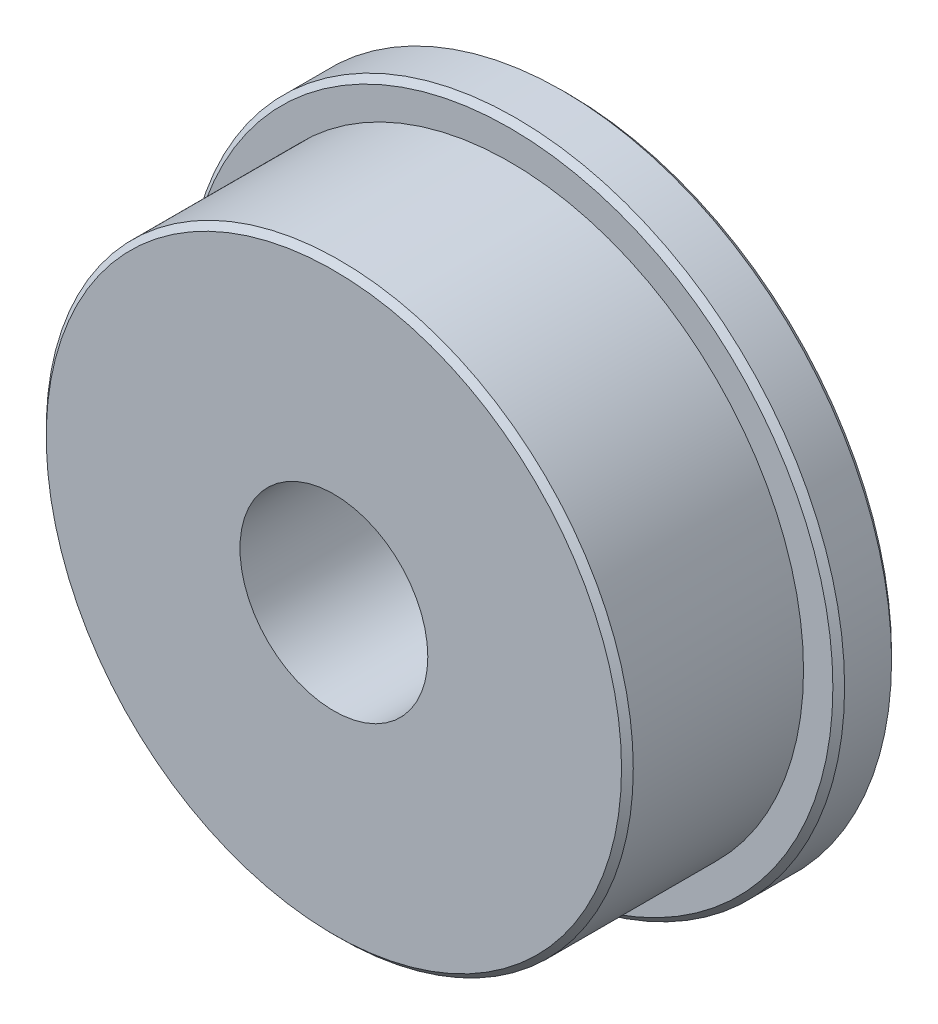
ISO-10303-21;
HEADER;
FILE_DESCRIPTION(('STEP AP214'),'2;1');
FILE_NAME('part.step','',(''),(''),'','','');
FILE_SCHEMA(('AUTOMOTIVE_DESIGN { 1 0 10303 214 1 1 1 1 }'));
ENDSEC;
DATA;
#1=APPLICATION_CONTEXT('core data for automotive mechanical design processes');
#2=APPLICATION_PROTOCOL_DEFINITION('international standard','automotive_design',2000,#1);
#3=PRODUCT_CONTEXT('',#1,'mechanical');
#4=PRODUCT('Part','Part','',(#3));
#5=PRODUCT_RELATED_PRODUCT_CATEGORY('part','',(#4));
#6=PRODUCT_DEFINITION_FORMATION('','',#4);
#7=PRODUCT_DEFINITION_CONTEXT('part definition',#1,'design');
#8=PRODUCT_DEFINITION('design','',#6,#7);
#9=PRODUCT_DEFINITION_SHAPE('','',#8);
#10=(LENGTH_UNIT() NAMED_UNIT(*) SI_UNIT(.MILLI.,.METRE.));
#11=(NAMED_UNIT(*) PLANE_ANGLE_UNIT() SI_UNIT($,.RADIAN.));
#12=(NAMED_UNIT(*) SI_UNIT($,.STERADIAN.) SOLID_ANGLE_UNIT());
#13=UNCERTAINTY_MEASURE_WITH_UNIT(LENGTH_MEASURE(1.E-05),#10,'distance_accuracy_value','');
#14=(GEOMETRIC_REPRESENTATION_CONTEXT(3) GLOBAL_UNCERTAINTY_ASSIGNED_CONTEXT((#13)) GLOBAL_UNIT_ASSIGNED_CONTEXT((#10,
#11,#12)) REPRESENTATION_CONTEXT('',''));
#15=CARTESIAN_POINT('',(0.,0.,0.));
#16=DIRECTION('',(0.,0.,1.));
#17=DIRECTION('',(1.,0.,0.));
#18=AXIS2_PLACEMENT_3D('',#15,#16,#17);
#19=CARTESIAN_POINT('',(0.,0.,4.00000000000004));
#20=DIRECTION('',(0.,0.,-1.));
#21=DIRECTION('',(-1.,0.,0.));
#22=AXIS2_PLACEMENT_3D('',#19,#20,#21);
#23=CONICAL_SURFACE('',#22,4.89999999998422,0.785398163397455);
#24=CARTESIAN_POINT('',(0.,0.,3.89999999998425));
#25=DIRECTION('',(0.,0.,1.));
#26=DIRECTION('',(1.,0.,0.));
#27=AXIS2_PLACEMENT_3D('',#24,#25,#26);
#28=CIRCLE('',#27,5.);
#29=CARTESIAN_POINT('',(5.,0.,3.89999999998422));
#30=VERTEX_POINT('',#29);
#31=EDGE_CURVE('E10',#30,#30,#28,.T.);
#32=ORIENTED_EDGE('',*,*,#31,.T.);
#33=EDGE_LOOP('',(#32));
#34=FACE_BOUND('',#33,.T.);
#35=CARTESIAN_POINT('',(0.,0.,4.00000000000004));
#36=DIRECTION('',(0.,0.,1.));
#37=DIRECTION('',(1.,0.,0.));
#38=AXIS2_PLACEMENT_3D('',#35,#36,#37);
#39=CIRCLE('',#38,4.89999999998422);
#40=CARTESIAN_POINT('',(4.89999999998422,0.,4.));
#41=VERTEX_POINT('',#40);
#42=EDGE_CURVE('E61',#41,#41,#39,.T.);
#43=ORIENTED_EDGE('',*,*,#42,.F.);
#44=EDGE_LOOP('',(#43));
#45=FACE_BOUND('',#44,.T.);
#46=ADVANCED_FACE('F30',(#34,#45),#23,.T.);
#47=CARTESIAN_POINT('',(0.,0.,0.));
#48=DIRECTION('',(0.,0.,1.));
#49=DIRECTION('',(1.,0.,0.));
#50=AXIS2_PLACEMENT_3D('',#47,#48,#49);
#51=CYLINDRICAL_SURFACE('',#50,5.00000000000001);
#52=CARTESIAN_POINT('',(0.,0.,1.00000000000004));
#53=DIRECTION('',(0.,0.,1.));
#54=DIRECTION('',(1.,0.,0.));
#55=AXIS2_PLACEMENT_3D('',#52,#53,#54);
#56=CIRCLE('',#55,5.00000000000002);
#57=CARTESIAN_POINT('',(5.,0.,1.));
#58=VERTEX_POINT('',#57);
#59=EDGE_CURVE('E36',#58,#58,#56,.T.);
#60=ORIENTED_EDGE('',*,*,#59,.T.);
#61=EDGE_LOOP('',(#60));
#62=FACE_BOUND('',#61,.T.);
#63=ORIENTED_EDGE('',*,*,#31,.F.);
#64=EDGE_LOOP('',(#63));
#65=FACE_BOUND('',#64,.T.);
#66=ADVANCED_FACE('F69',(#62,#65),#51,.T.);
#67=CARTESIAN_POINT('',(5.,0.,1.));
#68=DIRECTION('',(0.,0.,1.));
#69=DIRECTION('',(1.,0.,0.));
#70=AXIS2_PLACEMENT_3D('',#67,#68,#69);
#71=PLANE('',#70);
#72=CARTESIAN_POINT('',(0.,0.,1.00000000000004));
#73=DIRECTION('',(0.,0.,1.));
#74=DIRECTION('',(1.,0.,0.));
#75=AXIS2_PLACEMENT_3D('',#72,#73,#74);
#76=CIRCLE('',#75,5.49999999999995);
#77=CARTESIAN_POINT('',(5.49999999999993,0.,1.));
#78=VERTEX_POINT('',#77);
#79=EDGE_CURVE('E40',#78,#78,#76,.T.);
#80=ORIENTED_EDGE('',*,*,#79,.T.);
#81=EDGE_LOOP('',(#80));
#82=FACE_BOUND('',#81,.T.);
#83=ORIENTED_EDGE('',*,*,#59,.F.);
#84=EDGE_LOOP('',(#83));
#85=FACE_BOUND('',#84,.T.);
#86=ADVANCED_FACE('F73',(#82,#85),#71,.T.);
#87=CARTESIAN_POINT('',(0.,0.,1.00000000000004));
#88=DIRECTION('',(0.,0.,-1.));
#89=DIRECTION('',(-1.,0.,0.));
#90=AXIS2_PLACEMENT_3D('',#87,#88,#89);
#91=CONICAL_SURFACE('',#90,5.49999999999995,0.785398163396979);
#92=CARTESIAN_POINT('',(0.,0.,0.899999999999879));
#93=DIRECTION('',(0.,0.,1.));
#94=DIRECTION('',(1.,0.,0.));
#95=AXIS2_PLACEMENT_3D('',#92,#93,#94);
#96=CIRCLE('',#95,5.60000000000002);
#97=CARTESIAN_POINT('',(5.6,0.,0.89999999999984));
#98=VERTEX_POINT('',#97);
#99=EDGE_CURVE('E44',#98,#98,#96,.T.);
#100=ORIENTED_EDGE('',*,*,#99,.T.);
#101=EDGE_LOOP('',(#100));
#102=FACE_BOUND('',#101,.T.);
#103=ORIENTED_EDGE('',*,*,#79,.F.);
#104=EDGE_LOOP('',(#103));
#105=FACE_BOUND('',#104,.T.);
#106=ADVANCED_FACE('F77',(#102,#105),#91,.T.);
#107=CARTESIAN_POINT('',(0.,0.,0.));
#108=DIRECTION('',(0.,0.,1.));
#109=DIRECTION('',(1.,0.,0.));
#110=AXIS2_PLACEMENT_3D('',#107,#108,#109);
#111=CYLINDRICAL_SURFACE('',#110,5.60000000000002);
#112=CARTESIAN_POINT('',(0.,0.,0.10000000000003));
#113=DIRECTION('',(0.,0.,1.));
#114=DIRECTION('',(1.,0.,0.));
#115=AXIS2_PLACEMENT_3D('',#112,#113,#114);
#116=CIRCLE('',#115,5.60000000000003);
#117=CARTESIAN_POINT('',(5.6,0.,0.0999999999999902));
#118=VERTEX_POINT('',#117);
#119=EDGE_CURVE('E49',#118,#118,#116,.T.);
#120=ORIENTED_EDGE('',*,*,#119,.T.);
#121=EDGE_LOOP('',(#120));
#122=FACE_BOUND('',#121,.T.);
#123=ORIENTED_EDGE('',*,*,#99,.F.);
#124=EDGE_LOOP('',(#123));
#125=FACE_BOUND('',#124,.T.);
#126=ADVANCED_FACE('F84',(#122,#125),#111,.T.);
#127=CARTESIAN_POINT('',(0.,0.,0.10000000000003));
#128=DIRECTION('',(0.,0.,1.));
#129=DIRECTION('',(1.,0.,0.));
#130=AXIS2_PLACEMENT_3D('',#127,#128,#129);
#131=CONICAL_SURFACE('',#130,5.60000000000003,0.785398163397569);
#132=CARTESIAN_POINT('',(0.,0.,0.));
#133=DIRECTION('',(0.,0.,1.));
#134=DIRECTION('',(1.,0.,0.));
#135=AXIS2_PLACEMENT_3D('',#132,#133,#134);
#136=CIRCLE('',#135,5.50000000000001);
#137=CARTESIAN_POINT('',(5.49999999999998,0.,0.));
#138=VERTEX_POINT('',#137);
#139=EDGE_CURVE('E52',#138,#138,#136,.T.);
#140=ORIENTED_EDGE('',*,*,#139,.T.);
#141=EDGE_LOOP('',(#140));
#142=FACE_BOUND('',#141,.T.);
#143=ORIENTED_EDGE('',*,*,#119,.F.);
#144=EDGE_LOOP('',(#143));
#145=FACE_BOUND('',#144,.T.);
#146=ADVANCED_FACE('F88',(#142,#145),#131,.T.);
#147=CARTESIAN_POINT('',(5.49999999999998,0.,0.));
#148=DIRECTION('',(0.,0.,-1.));
#149=DIRECTION('',(-1.,0.,0.));
#150=AXIS2_PLACEMENT_3D('',#147,#148,#149);
#151=PLANE('',#150);
#152=CARTESIAN_POINT('',(0.,0.,0.));
#153=DIRECTION('',(0.,0.,1.));
#154=DIRECTION('',(1.,0.,0.));
#155=AXIS2_PLACEMENT_3D('',#152,#153,#154);
#156=CIRCLE('',#155,1.60000000000003);
#157=CARTESIAN_POINT('',(1.6,0.,0.));
#158=VERTEX_POINT('',#157);
#159=EDGE_CURVE('E55',#158,#158,#156,.T.);
#160=ORIENTED_EDGE('',*,*,#159,.T.);
#161=EDGE_LOOP('',(#160));
#162=FACE_BOUND('',#161,.T.);
#163=ORIENTED_EDGE('',*,*,#139,.F.);
#164=EDGE_LOOP('',(#163));
#165=FACE_BOUND('',#164,.T.);
#166=ADVANCED_FACE('F92',(#162,#165),#151,.T.);
#167=CARTESIAN_POINT('',(0.,0.,0.));
#168=DIRECTION('',(0.,0.,1.));
#169=DIRECTION('',(1.,0.,0.));
#170=AXIS2_PLACEMENT_3D('',#167,#168,#169);
#171=CYLINDRICAL_SURFACE('',#170,1.60000000000001);
#172=CARTESIAN_POINT('',(0.,0.,4.00000000000001));
#173=DIRECTION('',(0.,0.,1.));
#174=DIRECTION('',(1.,0.,0.));
#175=AXIS2_PLACEMENT_3D('',#172,#173,#174);
#176=CIRCLE('',#175,1.6);
#177=CARTESIAN_POINT('',(1.6,0.,4.));
#178=VERTEX_POINT('',#177);
#179=EDGE_CURVE('E58',#178,#178,#176,.T.);
#180=ORIENTED_EDGE('',*,*,#179,.T.);
#181=EDGE_LOOP('',(#180));
#182=FACE_BOUND('',#181,.T.);
#183=ORIENTED_EDGE('',*,*,#159,.F.);
#184=EDGE_LOOP('',(#183));
#185=FACE_BOUND('',#184,.T.);
#186=ADVANCED_FACE('F96',(#182,#185),#171,.F.);
#187=CARTESIAN_POINT('',(1.6,0.,4.00000000000001));
#188=DIRECTION('',(0.,0.,1.));
#189=DIRECTION('',(1.,0.,0.));
#190=AXIS2_PLACEMENT_3D('',#187,#188,#189);
#191=PLANE('',#190);
#192=ORIENTED_EDGE('',*,*,#42,.T.);
#193=EDGE_LOOP('',(#192));
#194=FACE_BOUND('',#193,.T.);
#195=ORIENTED_EDGE('',*,*,#179,.F.);
#196=EDGE_LOOP('',(#195));
#197=FACE_BOUND('',#196,.T.);
#198=ADVANCED_FACE('F65',(#194,#197),#191,.T.);
#199=CLOSED_SHELL('',(#46,#66,#86,#106,#126,#146,#166,#186,#198));
#200=MANIFOLD_SOLID_BREP('B2',#199);
#201=ADVANCED_BREP_SHAPE_REPRESENTATION('',(#18,#200),#14);
#202=SHAPE_DEFINITION_REPRESENTATION(#9,#201);
ENDSEC;
END-ISO-10303-21;
